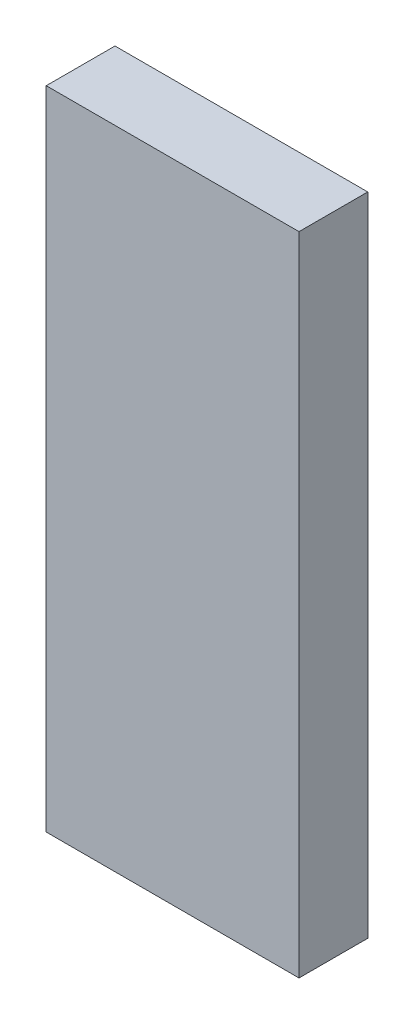
ISO-10303-21;
HEADER;
FILE_DESCRIPTION(('STEP AP214'),'2;1');
FILE_NAME('part.step','',(''),(''),'','','');
FILE_SCHEMA(('AUTOMOTIVE_DESIGN { 1 0 10303 214 1 1 1 1 }'));
ENDSEC;
DATA;
#1=APPLICATION_CONTEXT('core data for automotive mechanical design processes');
#2=APPLICATION_PROTOCOL_DEFINITION('international standard','automotive_design',2000,#1);
#3=PRODUCT_CONTEXT('',#1,'mechanical');
#4=PRODUCT('Part','Part','',(#3));
#5=PRODUCT_RELATED_PRODUCT_CATEGORY('part','',(#4));
#6=PRODUCT_DEFINITION_FORMATION('','',#4);
#7=PRODUCT_DEFINITION_CONTEXT('part definition',#1,'design');
#8=PRODUCT_DEFINITION('design','',#6,#7);
#9=PRODUCT_DEFINITION_SHAPE('','',#8);
#10=(LENGTH_UNIT() NAMED_UNIT(*) SI_UNIT(.MILLI.,.METRE.));
#11=(NAMED_UNIT(*) PLANE_ANGLE_UNIT() SI_UNIT($,.RADIAN.));
#12=(NAMED_UNIT(*) SI_UNIT($,.STERADIAN.) SOLID_ANGLE_UNIT());
#13=UNCERTAINTY_MEASURE_WITH_UNIT(LENGTH_MEASURE(1.E-05),#10,'distance_accuracy_value','');
#14=(GEOMETRIC_REPRESENTATION_CONTEXT(3) GLOBAL_UNCERTAINTY_ASSIGNED_CONTEXT((#13)) GLOBAL_UNIT_ASSIGNED_CONTEXT((#10,
#11,#12)) REPRESENTATION_CONTEXT('',''));
#15=CARTESIAN_POINT('',(0.,0.,0.));
#16=DIRECTION('',(0.,0.,1.));
#17=DIRECTION('',(1.,0.,0.));
#18=AXIS2_PLACEMENT_3D('',#15,#16,#17);
#19=CARTESIAN_POINT('',(0.62500002,1.59826706,0.33999932));
#20=DIRECTION('',(0.,0.,1.));
#21=DIRECTION('',(1.,0.,0.));
#22=AXIS2_PLACEMENT_3D('',#19,#20,#21);
#23=PLANE('',#22);
#24=DIRECTION('',(1.,0.,0.));
#25=VECTOR('',#24,1.);
#26=CARTESIAN_POINT('',(-0.62500002,1.59826706,0.33999932));
#27=LINE('',#26,#25);
#28=CARTESIAN_POINT('',(-0.62500002,1.59826706,0.33999932));
#29=VERTEX_POINT('',#28);
#30=CARTESIAN_POINT('',(0.62500002,1.59826706,0.33999932));
#31=VERTEX_POINT('',#30);
#32=EDGE_CURVE('E27',#29,#31,#27,.T.);
#33=ORIENTED_EDGE('',*,*,#32,.F.);
#34=DIRECTION('',(0.,1.,0.));
#35=VECTOR('',#34,1.);
#36=CARTESIAN_POINT('',(-0.62500002,-1.59826452,0.33999932));
#37=LINE('',#36,#35);
#38=CARTESIAN_POINT('',(-0.62500002,-1.59826452,0.33999932));
#39=VERTEX_POINT('',#38);
#40=EDGE_CURVE('E20',#39,#29,#37,.T.);
#41=ORIENTED_EDGE('',*,*,#40,.F.);
#42=DIRECTION('',(-1.,0.,0.));
#43=VECTOR('',#42,1.);
#44=CARTESIAN_POINT('',(0.62500002,-1.59826452,0.33999932));
#45=LINE('',#44,#43);
#46=CARTESIAN_POINT('',(0.62500002,-1.59826452,0.33999932));
#47=VERTEX_POINT('',#46);
#48=EDGE_CURVE('E70',#47,#39,#45,.T.);
#49=ORIENTED_EDGE('',*,*,#48,.F.);
#50=DIRECTION('',(0.,-1.,0.));
#51=VECTOR('',#50,1.);
#52=CARTESIAN_POINT('',(0.62500002,1.59826706,0.33999932));
#53=LINE('',#52,#51);
#54=EDGE_CURVE('E92',#31,#47,#53,.T.);
#55=ORIENTED_EDGE('',*,*,#54,.F.);
#56=EDGE_LOOP('',(#33,#41,#49,#55));
#57=FACE_BOUND('',#56,.T.);
#58=ADVANCED_FACE('F16',(#57),#23,.T.);
#59=CARTESIAN_POINT('',(0.62500002,1.59826706,0.));
#60=DIRECTION('',(0.,0.,1.));
#61=DIRECTION('',(1.,0.,0.));
#62=AXIS2_PLACEMENT_3D('',#59,#60,#61);
#63=PLANE('',#62);
#64=DIRECTION('',(0.,-1.,0.));
#65=VECTOR('',#64,1.);
#66=CARTESIAN_POINT('',(0.62500002,1.59826706,0.));
#67=LINE('',#66,#65);
#68=CARTESIAN_POINT('',(0.62500002,1.59826706,0.));
#69=VERTEX_POINT('',#68);
#70=CARTESIAN_POINT('',(0.62500002,-1.59826452,0.));
#71=VERTEX_POINT('',#70);
#72=EDGE_CURVE('E79',#69,#71,#67,.T.);
#73=ORIENTED_EDGE('',*,*,#72,.T.);
#74=DIRECTION('',(-1.,0.,0.));
#75=VECTOR('',#74,1.);
#76=CARTESIAN_POINT('',(0.62500002,-1.59826452,0.));
#77=LINE('',#76,#75);
#78=CARTESIAN_POINT('',(-0.62500002,-1.59826452,0.));
#79=VERTEX_POINT('',#78);
#80=EDGE_CURVE('E59',#71,#79,#77,.T.);
#81=ORIENTED_EDGE('',*,*,#80,.T.);
#82=DIRECTION('',(0.,1.,0.));
#83=VECTOR('',#82,1.);
#84=CARTESIAN_POINT('',(-0.62500002,-1.59826452,0.));
#85=LINE('',#84,#83);
#86=CARTESIAN_POINT('',(-0.62500002,1.59826706,0.));
#87=VERTEX_POINT('',#86);
#88=EDGE_CURVE('E81',#79,#87,#85,.T.);
#89=ORIENTED_EDGE('',*,*,#88,.T.);
#90=DIRECTION('',(1.,0.,0.));
#91=VECTOR('',#90,1.);
#92=CARTESIAN_POINT('',(-0.62500002,1.59826706,0.));
#93=LINE('',#92,#91);
#94=EDGE_CURVE('E10',#87,#69,#93,.T.);
#95=ORIENTED_EDGE('',*,*,#94,.T.);
#96=EDGE_LOOP('',(#73,#81,#89,#95));
#97=FACE_BOUND('',#96,.T.);
#98=ADVANCED_FACE('F78',(#97),#63,.F.);
#99=CARTESIAN_POINT('',(-0.62500002,1.59826706,0.));
#100=DIRECTION('',(0.,1.,0.));
#101=DIRECTION('',(1.,0.,0.));
#102=AXIS2_PLACEMENT_3D('',#99,#100,#101);
#103=PLANE('',#102);
#104=DIRECTION('',(0.,0.,1.));
#105=VECTOR('',#104,1.);
#106=CARTESIAN_POINT('',(-0.62500002,1.59826706,0.));
#107=LINE('',#106,#105);
#108=EDGE_CURVE('E108',#87,#29,#107,.T.);
#109=ORIENTED_EDGE('',*,*,#108,.T.);
#110=ORIENTED_EDGE('',*,*,#32,.T.);
#111=DIRECTION('',(0.,0.,1.));
#112=VECTOR('',#111,1.);
#113=CARTESIAN_POINT('',(0.62500002,1.59826706,0.));
#114=LINE('',#113,#112);
#115=EDGE_CURVE('E86',#69,#31,#114,.T.);
#116=ORIENTED_EDGE('',*,*,#115,.F.);
#117=ORIENTED_EDGE('',*,*,#94,.F.);
#118=EDGE_LOOP('',(#109,#110,#116,#117));
#119=FACE_BOUND('',#118,.T.);
#120=ADVANCED_FACE('F90',(#119),#103,.T.);
#121=CARTESIAN_POINT('',(-0.62500002,-1.59826452,0.));
#122=DIRECTION('',(-1.,0.,0.));
#123=DIRECTION('',(0.,0.,1.));
#124=AXIS2_PLACEMENT_3D('',#121,#122,#123);
#125=PLANE('',#124);
#126=DIRECTION('',(0.,0.,1.));
#127=VECTOR('',#126,1.);
#128=CARTESIAN_POINT('',(-0.62500002,-1.59826452,0.));
#129=LINE('',#128,#127);
#130=EDGE_CURVE('E101',#79,#39,#129,.T.);
#131=ORIENTED_EDGE('',*,*,#130,.T.);
#132=ORIENTED_EDGE('',*,*,#40,.T.);
#133=ORIENTED_EDGE('',*,*,#108,.F.);
#134=ORIENTED_EDGE('',*,*,#88,.F.);
#135=EDGE_LOOP('',(#131,#132,#133,#134));
#136=FACE_BOUND('',#135,.T.);
#137=ADVANCED_FACE('F125',(#136),#125,.T.);
#138=CARTESIAN_POINT('',(0.62500002,-1.59826452,0.));
#139=DIRECTION('',(0.,-1.,0.));
#140=DIRECTION('',(0.,0.,-1.));
#141=AXIS2_PLACEMENT_3D('',#138,#139,#140);
#142=PLANE('',#141);
#143=DIRECTION('',(0.,0.,1.));
#144=VECTOR('',#143,1.);
#145=CARTESIAN_POINT('',(0.62500002,-1.59826452,0.));
#146=LINE('',#145,#144);
#147=EDGE_CURVE('E87',#71,#47,#146,.T.);
#148=ORIENTED_EDGE('',*,*,#147,.T.);
#149=ORIENTED_EDGE('',*,*,#48,.T.);
#150=ORIENTED_EDGE('',*,*,#130,.F.);
#151=ORIENTED_EDGE('',*,*,#80,.F.);
#152=EDGE_LOOP('',(#148,#149,#150,#151));
#153=FACE_BOUND('',#152,.T.);
#154=ADVANCED_FACE('F126',(#153),#142,.T.);
#155=CARTESIAN_POINT('',(0.62500002,1.59826706,0.));
#156=DIRECTION('',(1.,0.,0.));
#157=DIRECTION('',(0.,1.,0.));
#158=AXIS2_PLACEMENT_3D('',#155,#156,#157);
#159=PLANE('',#158);
#160=ORIENTED_EDGE('',*,*,#115,.T.);
#161=ORIENTED_EDGE('',*,*,#54,.T.);
#162=ORIENTED_EDGE('',*,*,#147,.F.);
#163=ORIENTED_EDGE('',*,*,#72,.F.);
#164=EDGE_LOOP('',(#160,#161,#162,#163));
#165=FACE_BOUND('',#164,.T.);
#166=ADVANCED_FACE('F18',(#165),#159,.T.);
#167=CLOSED_SHELL('',(#58,#98,#120,#137,#154,#166));
#168=MANIFOLD_SOLID_BREP('B1',#167);
#169=ADVANCED_BREP_SHAPE_REPRESENTATION('',(#18,#168),#14);
#170=SHAPE_DEFINITION_REPRESENTATION(#9,#169);
ENDSEC;
END-ISO-10303-21;
